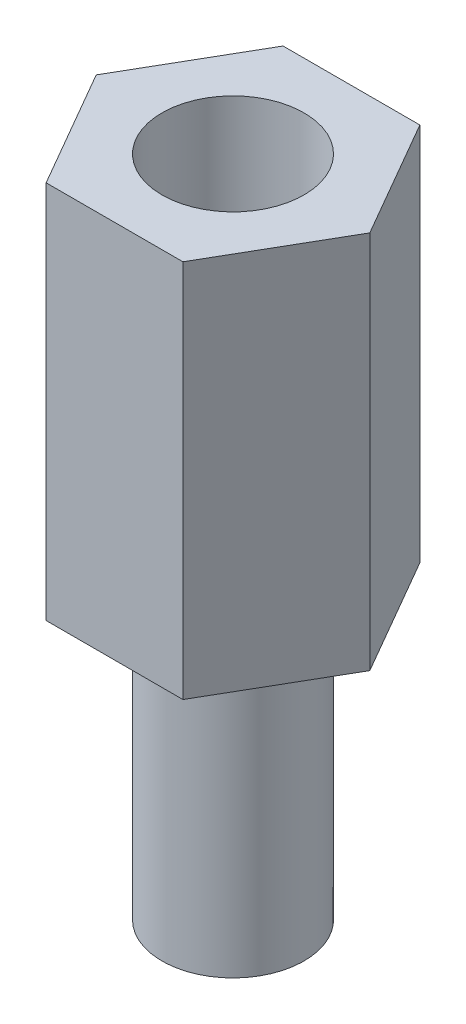
ISO-10303-21;
HEADER;
FILE_DESCRIPTION(('STEP AP214'),'2;1');
FILE_NAME('part.step','',(''),(''),'','','');
FILE_SCHEMA(('AUTOMOTIVE_DESIGN { 1 0 10303 214 1 1 1 1 }'));
ENDSEC;
DATA;
#1=APPLICATION_CONTEXT('core data for automotive mechanical design processes');
#2=APPLICATION_PROTOCOL_DEFINITION('international standard','automotive_design',2000,#1);
#3=PRODUCT_CONTEXT('',#1,'mechanical');
#4=PRODUCT('Part','Part','',(#3));
#5=PRODUCT_RELATED_PRODUCT_CATEGORY('part','',(#4));
#6=PRODUCT_DEFINITION_FORMATION('','',#4);
#7=PRODUCT_DEFINITION_CONTEXT('part definition',#1,'design');
#8=PRODUCT_DEFINITION('design','',#6,#7);
#9=PRODUCT_DEFINITION_SHAPE('','',#8);
#10=(LENGTH_UNIT() NAMED_UNIT(*) SI_UNIT(.MILLI.,.METRE.));
#11=(NAMED_UNIT(*) PLANE_ANGLE_UNIT() SI_UNIT($,.RADIAN.));
#12=(NAMED_UNIT(*) SI_UNIT($,.STERADIAN.) SOLID_ANGLE_UNIT());
#13=UNCERTAINTY_MEASURE_WITH_UNIT(LENGTH_MEASURE(1.E-05),#10,'distance_accuracy_value','');
#14=(GEOMETRIC_REPRESENTATION_CONTEXT(3) GLOBAL_UNCERTAINTY_ASSIGNED_CONTEXT((#13)) GLOBAL_UNIT_ASSIGNED_CONTEXT((#10,
#11,#12)) REPRESENTATION_CONTEXT('',''));
#15=CARTESIAN_POINT('',(0.,0.,0.));
#16=DIRECTION('',(0.,0.,1.));
#17=DIRECTION('',(1.,0.,0.));
#18=AXIS2_PLACEMENT_3D('',#15,#16,#17);
#19=CARTESIAN_POINT('',(0.,-6.,0.));
#20=DIRECTION('',(0.,1.,0.));
#21=DIRECTION('',(0.,0.,1.));
#22=AXIS2_PLACEMENT_3D('',#19,#20,#21);
#23=CYLINDRICAL_SURFACE('',#22,1.5);
#24=CARTESIAN_POINT('',(0.,-6.,0.));
#25=DIRECTION('',(0.,-1.,0.));
#26=DIRECTION('',(0.,0.,-1.));
#27=AXIS2_PLACEMENT_3D('',#24,#25,#26);
#28=CIRCLE('',#27,1.5);
#29=CARTESIAN_POINT('',(0.,-6.,-1.5));
#30=VERTEX_POINT('',#29);
#31=EDGE_CURVE('E11',#30,#30,#28,.T.);
#32=ORIENTED_EDGE('',*,*,#31,.F.);
#33=EDGE_LOOP('',(#32));
#34=FACE_BOUND('',#33,.T.);
#35=CARTESIAN_POINT('',(0.,0.,0.));
#36=DIRECTION('',(0.,-1.,0.));
#37=DIRECTION('',(0.,0.,-1.));
#38=AXIS2_PLACEMENT_3D('',#35,#36,#37);
#39=CIRCLE('',#38,1.5);
#40=CARTESIAN_POINT('',(0.,0.,-1.5));
#41=VERTEX_POINT('',#40);
#42=EDGE_CURVE('E44',#41,#41,#39,.T.);
#43=ORIENTED_EDGE('',*,*,#42,.T.);
#44=EDGE_LOOP('',(#43));
#45=FACE_BOUND('',#44,.T.);
#46=ADVANCED_FACE('F41',(#34,#45),#23,.T.);
#47=CARTESIAN_POINT('',(0.,-6.,0.));
#48=DIRECTION('',(0.,-1.,0.));
#49=DIRECTION('',(0.,0.,-1.));
#50=AXIS2_PLACEMENT_3D('',#47,#48,#49);
#51=PLANE('',#50);
#52=ORIENTED_EDGE('',*,*,#31,.T.);
#53=EDGE_LOOP('',(#52));
#54=FACE_BOUND('',#53,.T.);
#55=ADVANCED_FACE('F56',(#54),#51,.T.);
#56=CARTESIAN_POINT('',(0.,0.,0.));
#57=DIRECTION('',(0.,-1.,0.));
#58=DIRECTION('',(0.,0.,-1.));
#59=AXIS2_PLACEMENT_3D('',#56,#57,#58);
#60=PLANE('',#59);
#61=ORIENTED_EDGE('',*,*,#42,.F.);
#62=EDGE_LOOP('',(#61));
#63=FACE_BOUND('',#62,.T.);
#64=ADVANCED_FACE('F54',(#63),#60,.F.);
#65=CLOSED_SHELL('',(#46,#55,#64));
#66=MANIFOLD_SOLID_BREP('B2',#65);
#67=CARTESIAN_POINT('',(0.,8.,0.));
#68=DIRECTION('',(0.,1.,0.));
#69=DIRECTION('',(0.,0.,1.));
#70=AXIS2_PLACEMENT_3D('',#67,#68,#69);
#71=PLANE('',#70);
#72=DIRECTION('',(1.,0.,0.));
#73=VECTOR('',#72,1.);
#74=CARTESIAN_POINT('',(-1.44337567297405,8.,2.5));
#75=LINE('',#74,#73);
#76=CARTESIAN_POINT('',(-1.44337567297405,8.,2.5));
#77=VERTEX_POINT('',#76);
#78=CARTESIAN_POINT('',(1.44337567297408,8.,2.5));
#79=VERTEX_POINT('',#78);
#80=EDGE_CURVE('E178',#77,#79,#75,.T.);
#81=ORIENTED_EDGE('',*,*,#80,.T.);
#82=DIRECTION('',(0.500000000000001,0.,-0.866025403784438));
#83=VECTOR('',#82,1.);
#84=CARTESIAN_POINT('',(1.44337567297408,8.,2.5));
#85=LINE('',#84,#83);
#86=CARTESIAN_POINT('',(2.88675134594815,8.,0.));
#87=VERTEX_POINT('',#86);
#88=EDGE_CURVE('E136',#79,#87,#85,.T.);
#89=ORIENTED_EDGE('',*,*,#88,.T.);
#90=DIRECTION('',(-0.500000000000001,0.,-0.866025403784438));
#91=VECTOR('',#90,1.);
#92=CARTESIAN_POINT('',(2.88675134594815,8.,0.));
#93=LINE('',#92,#91);
#94=CARTESIAN_POINT('',(1.44337567297408,8.,-2.50000000000001));
#95=VERTEX_POINT('',#94);
#96=EDGE_CURVE('E149',#87,#95,#93,.T.);
#97=ORIENTED_EDGE('',*,*,#96,.T.);
#98=DIRECTION('',(-1.,0.,0.));
#99=VECTOR('',#98,1.);
#100=CARTESIAN_POINT('',(1.44337567297408,8.,-2.50000000000001));
#101=LINE('',#100,#99);
#102=CARTESIAN_POINT('',(-1.44337567297405,8.,-2.50000000000001));
#103=VERTEX_POINT('',#102);
#104=EDGE_CURVE('E143',#95,#103,#101,.T.);
#105=ORIENTED_EDGE('',*,*,#104,.T.);
#106=DIRECTION('',(-0.5,0.,0.866025403784438));
#107=VECTOR('',#106,1.);
#108=CARTESIAN_POINT('',(-1.44337567297405,8.,-2.50000000000001));
#109=LINE('',#108,#107);
#110=CARTESIAN_POINT('',(-2.88675134594812,8.,0.));
#111=VERTEX_POINT('',#110);
#112=EDGE_CURVE('E147',#103,#111,#109,.T.);
#113=ORIENTED_EDGE('',*,*,#112,.T.);
#114=DIRECTION('',(0.5,0.,0.866025403784438));
#115=VECTOR('',#114,1.);
#116=CARTESIAN_POINT('',(-2.88675134594812,8.,0.));
#117=LINE('',#116,#115);
#118=EDGE_CURVE('E99',#111,#77,#117,.T.);
#119=ORIENTED_EDGE('',*,*,#118,.T.);
#120=EDGE_LOOP('',(#81,#89,#97,#105,#113,#119));
#121=FACE_BOUND('',#120,.T.);
#122=CARTESIAN_POINT('',(0.,8.,0.));
#123=DIRECTION('',(0.,1.,0.));
#124=DIRECTION('',(0.,0.,1.));
#125=AXIS2_PLACEMENT_3D('',#122,#123,#124);
#126=CIRCLE('',#125,1.5);
#127=CARTESIAN_POINT('',(0.,8.,1.5));
#128=VERTEX_POINT('',#127);
#129=EDGE_CURVE('E171',#128,#128,#126,.T.);
#130=ORIENTED_EDGE('',*,*,#129,.F.);
#131=EDGE_LOOP('',(#130));
#132=FACE_BOUND('',#131,.T.);
#133=ADVANCED_FACE('F82',(#121,#132),#71,.T.);
#134=CARTESIAN_POINT('',(0.,0.,0.));
#135=DIRECTION('',(0.,1.,0.));
#136=DIRECTION('',(0.,0.,1.));
#137=AXIS2_PLACEMENT_3D('',#134,#135,#136);
#138=PLANE('',#137);
#139=DIRECTION('',(1.,0.,0.));
#140=VECTOR('',#139,1.);
#141=CARTESIAN_POINT('',(-1.44337567297405,0.,2.5));
#142=LINE('',#141,#140);
#143=CARTESIAN_POINT('',(-1.44337567297405,0.,2.5));
#144=VERTEX_POINT('',#143);
#145=CARTESIAN_POINT('',(1.44337567297408,0.,2.5));
#146=VERTEX_POINT('',#145);
#147=EDGE_CURVE('E167',#144,#146,#142,.T.);
#148=ORIENTED_EDGE('',*,*,#147,.F.);
#149=DIRECTION('',(0.5,0.,0.866025403784438));
#150=VECTOR('',#149,1.);
#151=CARTESIAN_POINT('',(-2.88675134594812,0.,0.));
#152=LINE('',#151,#150);
#153=CARTESIAN_POINT('',(-2.88675134594812,0.,0.));
#154=VERTEX_POINT('',#153);
#155=EDGE_CURVE('E128',#154,#144,#152,.T.);
#156=ORIENTED_EDGE('',*,*,#155,.F.);
#157=DIRECTION('',(-0.5,0.,0.866025403784438));
#158=VECTOR('',#157,1.);
#159=CARTESIAN_POINT('',(-1.44337567297405,0.,-2.50000000000001));
#160=LINE('',#159,#158);
#161=CARTESIAN_POINT('',(-1.44337567297405,0.,-2.50000000000001));
#162=VERTEX_POINT('',#161);
#163=EDGE_CURVE('E122',#162,#154,#160,.T.);
#164=ORIENTED_EDGE('',*,*,#163,.F.);
#165=DIRECTION('',(-1.,0.,0.));
#166=VECTOR('',#165,1.);
#167=CARTESIAN_POINT('',(1.44337567297408,0.,-2.50000000000001));
#168=LINE('',#167,#166);
#169=CARTESIAN_POINT('',(1.44337567297408,0.,-2.50000000000001));
#170=VERTEX_POINT('',#169);
#171=EDGE_CURVE('E157',#170,#162,#168,.T.);
#172=ORIENTED_EDGE('',*,*,#171,.F.);
#173=DIRECTION('',(-0.500000000000001,0.,-0.866025403784438));
#174=VECTOR('',#173,1.);
#175=CARTESIAN_POINT('',(2.88675134594815,0.,0.));
#176=LINE('',#175,#174);
#177=CARTESIAN_POINT('',(2.88675134594815,0.,0.));
#178=VERTEX_POINT('',#177);
#179=EDGE_CURVE('E173',#178,#170,#176,.T.);
#180=ORIENTED_EDGE('',*,*,#179,.F.);
#181=DIRECTION('',(0.500000000000001,0.,-0.866025403784438));
#182=VECTOR('',#181,1.);
#183=CARTESIAN_POINT('',(1.44337567297408,0.,2.5));
#184=LINE('',#183,#182);
#185=EDGE_CURVE('E170',#146,#178,#184,.T.);
#186=ORIENTED_EDGE('',*,*,#185,.F.);
#187=EDGE_LOOP('',(#148,#156,#164,#172,#180,#186));
#188=FACE_BOUND('',#187,.T.);
#189=CARTESIAN_POINT('',(0.,0.,0.));
#190=DIRECTION('',(0.,1.,0.));
#191=DIRECTION('',(0.,0.,1.));
#192=AXIS2_PLACEMENT_3D('',#189,#190,#191);
#193=CIRCLE('',#192,1.5);
#194=CARTESIAN_POINT('',(0.,0.,1.5));
#195=VERTEX_POINT('',#194);
#196=EDGE_CURVE('E271',#195,#195,#193,.T.);
#197=ORIENTED_EDGE('',*,*,#196,.T.);
#198=EDGE_LOOP('',(#197));
#199=FACE_BOUND('',#198,.T.);
#200=ADVANCED_FACE('F187',(#188,#199),#138,.F.);
#201=CARTESIAN_POINT('',(-1.44337567297405,8.,2.5));
#202=DIRECTION('',(0.,0.,-1.));
#203=DIRECTION('',(-1.,0.,0.));
#204=AXIS2_PLACEMENT_3D('',#201,#202,#203);
#205=PLANE('',#204);
#206=ORIENTED_EDGE('',*,*,#147,.T.);
#207=DIRECTION('',(0.,-1.,0.));
#208=VECTOR('',#207,1.);
#209=CARTESIAN_POINT('',(1.44337567297408,8.,2.5));
#210=LINE('',#209,#208);
#211=EDGE_CURVE('E39',#79,#146,#210,.T.);
#212=ORIENTED_EDGE('',*,*,#211,.F.);
#213=ORIENTED_EDGE('',*,*,#80,.F.);
#214=DIRECTION('',(0.,-1.,0.));
#215=VECTOR('',#214,1.);
#216=CARTESIAN_POINT('',(-1.44337567297405,8.,2.5));
#217=LINE('',#216,#215);
#218=EDGE_CURVE('E163',#77,#144,#217,.T.);
#219=ORIENTED_EDGE('',*,*,#218,.T.);
#220=EDGE_LOOP('',(#206,#212,#213,#219));
#221=FACE_BOUND('',#220,.T.);
#222=ADVANCED_FACE('F84',(#221),#205,.F.);
#223=CARTESIAN_POINT('',(1.44337567297408,8.,2.5));
#224=DIRECTION('',(-0.866025403784438,0.,-0.500000000000001));
#225=DIRECTION('',(-0.500000000000001,0.,0.866025403784438));
#226=AXIS2_PLACEMENT_3D('',#223,#224,#225);
#227=PLANE('',#226);
#228=ORIENTED_EDGE('',*,*,#185,.T.);
#229=DIRECTION('',(0.,-1.,0.));
#230=VECTOR('',#229,1.);
#231=CARTESIAN_POINT('',(2.88675134594815,8.,0.));
#232=LINE('',#231,#230);
#233=EDGE_CURVE('E91',#87,#178,#232,.T.);
#234=ORIENTED_EDGE('',*,*,#233,.F.);
#235=ORIENTED_EDGE('',*,*,#88,.F.);
#236=ORIENTED_EDGE('',*,*,#211,.T.);
#237=EDGE_LOOP('',(#228,#234,#235,#236));
#238=FACE_BOUND('',#237,.T.);
#239=ADVANCED_FACE('F212',(#238),#227,.F.);
#240=CARTESIAN_POINT('',(2.88675134594815,8.,0.));
#241=DIRECTION('',(-0.866025403784438,0.,0.500000000000001));
#242=DIRECTION('',(0.500000000000001,0.,0.866025403784438));
#243=AXIS2_PLACEMENT_3D('',#240,#241,#242);
#244=PLANE('',#243);
#245=ORIENTED_EDGE('',*,*,#179,.T.);
#246=DIRECTION('',(0.,-1.,0.));
#247=VECTOR('',#246,1.);
#248=CARTESIAN_POINT('',(1.44337567297408,8.,-2.50000000000001));
#249=LINE('',#248,#247);
#250=EDGE_CURVE('E158',#95,#170,#249,.T.);
#251=ORIENTED_EDGE('',*,*,#250,.F.);
#252=ORIENTED_EDGE('',*,*,#96,.F.);
#253=ORIENTED_EDGE('',*,*,#233,.T.);
#254=EDGE_LOOP('',(#245,#251,#252,#253));
#255=FACE_BOUND('',#254,.T.);
#256=ADVANCED_FACE('F184',(#255),#244,.F.);
#257=CARTESIAN_POINT('',(1.44337567297408,8.,-2.50000000000001));
#258=DIRECTION('',(0.,0.,1.));
#259=DIRECTION('',(1.,0.,0.));
#260=AXIS2_PLACEMENT_3D('',#257,#258,#259);
#261=PLANE('',#260);
#262=ORIENTED_EDGE('',*,*,#171,.T.);
#263=DIRECTION('',(0.,-1.,0.));
#264=VECTOR('',#263,1.);
#265=CARTESIAN_POINT('',(-1.44337567297405,8.,-2.50000000000001));
#266=LINE('',#265,#264);
#267=EDGE_CURVE('E154',#103,#162,#266,.T.);
#268=ORIENTED_EDGE('',*,*,#267,.F.);
#269=ORIENTED_EDGE('',*,*,#104,.F.);
#270=ORIENTED_EDGE('',*,*,#250,.T.);
#271=EDGE_LOOP('',(#262,#268,#269,#270));
#272=FACE_BOUND('',#271,.T.);
#273=ADVANCED_FACE('F155',(#272),#261,.F.);
#274=CARTESIAN_POINT('',(-1.44337567297405,8.,-2.50000000000001));
#275=DIRECTION('',(0.866025403784439,0.,0.5));
#276=DIRECTION('',(0.5,0.,-0.866025403784439));
#277=AXIS2_PLACEMENT_3D('',#274,#275,#276);
#278=PLANE('',#277);
#279=ORIENTED_EDGE('',*,*,#163,.T.);
#280=DIRECTION('',(0.,-1.,0.));
#281=VECTOR('',#280,1.);
#282=CARTESIAN_POINT('',(-2.88675134594812,8.,0.));
#283=LINE('',#282,#281);
#284=EDGE_CURVE('E159',#111,#154,#283,.T.);
#285=ORIENTED_EDGE('',*,*,#284,.F.);
#286=ORIENTED_EDGE('',*,*,#112,.F.);
#287=ORIENTED_EDGE('',*,*,#267,.T.);
#288=EDGE_LOOP('',(#279,#285,#286,#287));
#289=FACE_BOUND('',#288,.T.);
#290=ADVANCED_FACE('F161',(#289),#278,.F.);
#291=CARTESIAN_POINT('',(-2.88675134594812,8.,0.));
#292=DIRECTION('',(0.866025403784438,0.,-0.5));
#293=DIRECTION('',(-0.5,0.,-0.866025403784438));
#294=AXIS2_PLACEMENT_3D('',#291,#292,#293);
#295=PLANE('',#294);
#296=ORIENTED_EDGE('',*,*,#155,.T.);
#297=ORIENTED_EDGE('',*,*,#218,.F.);
#298=ORIENTED_EDGE('',*,*,#118,.F.);
#299=ORIENTED_EDGE('',*,*,#284,.T.);
#300=EDGE_LOOP('',(#296,#297,#298,#299));
#301=FACE_BOUND('',#300,.T.);
#302=ADVANCED_FACE('F192',(#301),#295,.F.);
#303=CARTESIAN_POINT('',(0.,8.,0.));
#304=DIRECTION('',(0.,-1.,0.));
#305=DIRECTION('',(0.,0.,-1.));
#306=AXIS2_PLACEMENT_3D('',#303,#304,#305);
#307=CYLINDRICAL_SURFACE('',#306,1.5);
#308=ORIENTED_EDGE('',*,*,#129,.T.);
#309=EDGE_LOOP('',(#308));
#310=FACE_BOUND('',#309,.T.);
#311=ORIENTED_EDGE('',*,*,#196,.F.);
#312=EDGE_LOOP('',(#311));
#313=FACE_BOUND('',#312,.T.);
#314=ADVANCED_FACE('F194',(#310,#313),#307,.F.);
#315=CLOSED_SHELL('',(#133,#200,#222,#239,#256,#273,#290,#302,#314));
#316=MANIFOLD_SOLID_BREP('B6',#315);
#317=ADVANCED_BREP_SHAPE_REPRESENTATION('',(#18,#66,#316),#14);
#318=SHAPE_DEFINITION_REPRESENTATION(#9,#317);
ENDSEC;
END-ISO-10303-21;
